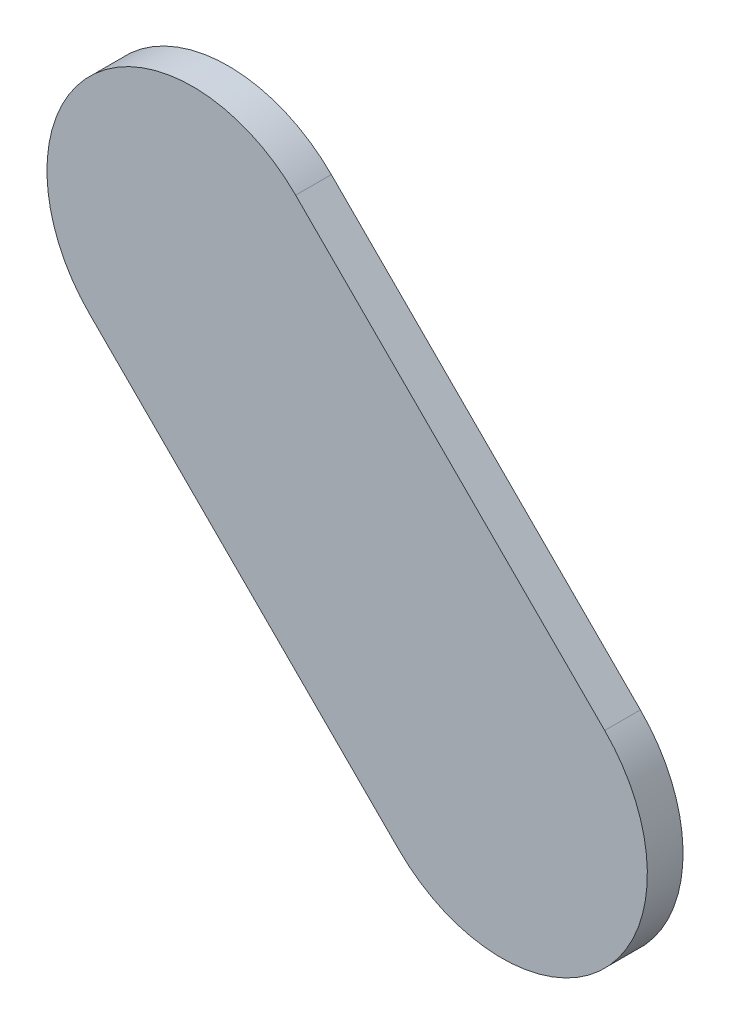
ISO-10303-21;
HEADER;
FILE_DESCRIPTION(('STEP AP214'),'2;1');
FILE_NAME('part.step','',(''),(''),'','','');
FILE_SCHEMA(('AUTOMOTIVE_DESIGN { 1 0 10303 214 1 1 1 1 }'));
ENDSEC;
DATA;
#1=APPLICATION_CONTEXT('core data for automotive mechanical design processes');
#2=APPLICATION_PROTOCOL_DEFINITION('international standard','automotive_design',2000,#1);
#3=PRODUCT_CONTEXT('',#1,'mechanical');
#4=PRODUCT('Part','Part','',(#3));
#5=PRODUCT_RELATED_PRODUCT_CATEGORY('part','',(#4));
#6=PRODUCT_DEFINITION_FORMATION('','',#4);
#7=PRODUCT_DEFINITION_CONTEXT('part definition',#1,'design');
#8=PRODUCT_DEFINITION('design','',#6,#7);
#9=PRODUCT_DEFINITION_SHAPE('','',#8);
#10=(LENGTH_UNIT() NAMED_UNIT(*) SI_UNIT(.MILLI.,.METRE.));
#11=(NAMED_UNIT(*) PLANE_ANGLE_UNIT() SI_UNIT($,.RADIAN.));
#12=(NAMED_UNIT(*) SI_UNIT($,.STERADIAN.) SOLID_ANGLE_UNIT());
#13=UNCERTAINTY_MEASURE_WITH_UNIT(LENGTH_MEASURE(1.E-05),#10,'distance_accuracy_value','');
#14=(GEOMETRIC_REPRESENTATION_CONTEXT(3) GLOBAL_UNCERTAINTY_ASSIGNED_CONTEXT((#13)) GLOBAL_UNIT_ASSIGNED_CONTEXT((#10,
#11,#12)) REPRESENTATION_CONTEXT('',''));
#15=CARTESIAN_POINT('',(0.,0.,0.));
#16=DIRECTION('',(0.,0.,1.));
#17=DIRECTION('',(1.,0.,0.));
#18=AXIS2_PLACEMENT_3D('',#15,#16,#17);
#19=CARTESIAN_POINT('',(3.725928999428,6.971484039131,0.79916));
#20=DIRECTION('',(0.,0.,1.));
#21=DIRECTION('',(1.,0.,0.));
#22=AXIS2_PLACEMENT_3D('',#19,#20,#21);
#23=PLANE('',#22);
#24=CARTESIAN_POINT('',(3.577543,7.119350434268,0.79916));
#25=DIRECTION('',(0.,0.,1.));
#26=DIRECTION('',(1.,0.,0.));
#27=AXIS2_PLACEMENT_3D('',#24,#25,#26);
#28=CIRCLE('',#27,0.140000472348);
#29=CARTESIAN_POINT('',(3.47854788883356,7.0203554441665,0.79916));
#30=VERTEX_POINT('',#29);
#31=CARTESIAN_POINT('',(3.67653836426737,7.21834563673356,0.79916));
#32=VERTEX_POINT('',#31);
#33=EDGE_CURVE('E20',#30,#32,#28,.F.);
#34=ORIENTED_EDGE('',*,*,#33,.F.);
#35=DIRECTION('',(-0.707107575236102,0.707105987136102,0.));
#36=VECTOR('',#35,1.);
#37=CARTESIAN_POINT('',(3.775533000001,6.723371000001,0.79916));
#38=LINE('',#37,#36);
#39=CARTESIAN_POINT('',(3.77553308090159,6.72337091910059,0.79916));
#40=VERTEX_POINT('',#39);
#41=EDGE_CURVE('E65',#30,#40,#38,.F.);
#42=ORIENTED_EDGE('',*,*,#41,.T.);
#43=CARTESIAN_POINT('',(3.874528,6.822365333,0.79916));
#44=DIRECTION('',(0.,0.,1.));
#45=DIRECTION('',(1.,0.,0.));
#46=AXIS2_PLACEMENT_3D('',#43,#44,#45);
#47=CIRCLE('',#46,0.140000072315);
#48=CARTESIAN_POINT('',(3.97352288933319,6.9213604446662,0.79916));
#49=VERTEX_POINT('',#48);
#50=EDGE_CURVE('E57',#49,#40,#47,.F.);
#51=ORIENTED_EDGE('',*,*,#50,.F.);
#52=DIRECTION('',(0.707105987136602,-0.707107575235602,0.));
#53=VECTOR('',#52,1.);
#54=CARTESIAN_POINT('',(3.676538334001,7.218345667,0.79916));
#55=LINE('',#54,#53);
#56=EDGE_CURVE('E64',#49,#32,#55,.F.);
#57=ORIENTED_EDGE('',*,*,#56,.T.);
#58=EDGE_LOOP('',(#34,#42,#51,#57));
#59=FACE_BOUND('',#58,.T.);
#60=ADVANCED_FACE('F17',(#59),#23,.T.);
#61=CARTESIAN_POINT('',(3.775533000001,6.723371000001,0.76487));
#62=DIRECTION('',(0.707105987136102,0.707107575236102,0.));
#63=DIRECTION('',(-0.707107575236102,0.707105987136102,0.));
#64=AXIS2_PLACEMENT_3D('',#61,#62,#63);
#65=PLANE('',#64);
#66=DIRECTION('',(0.,0.,1.));
#67=VECTOR('',#66,1.);
#68=CARTESIAN_POINT('',(3.47854800000002,7.02035533300002,0.76487));
#69=LINE('',#68,#67);
#70=CARTESIAN_POINT('',(3.47854788883345,7.02035544416632,0.76487));
#71=VERTEX_POINT('',#70);
#72=EDGE_CURVE('E68',#71,#30,#69,.T.);
#73=ORIENTED_EDGE('',*,*,#72,.F.);
#74=DIRECTION('',(-0.707107575236587,0.707105987135616,0.));
#75=VECTOR('',#74,1.);
#76=CARTESIAN_POINT('',(3.775533000001,6.723371000001,0.76487));
#77=LINE('',#76,#75);
#78=CARTESIAN_POINT('',(3.77553308090163,6.72337091910056,0.76487));
#79=VERTEX_POINT('',#78);
#80=EDGE_CURVE('E72',#79,#71,#77,.T.);
#81=ORIENTED_EDGE('',*,*,#80,.F.);
#82=DIRECTION('',(0.,0.,1.));
#83=VECTOR('',#82,1.);
#84=CARTESIAN_POINT('',(3.775533000001,6.723371000001,0.76487));
#85=LINE('',#84,#83);
#86=EDGE_CURVE('E60',#40,#79,#85,.F.);
#87=ORIENTED_EDGE('',*,*,#86,.F.);
#88=ORIENTED_EDGE('',*,*,#41,.F.);
#89=EDGE_LOOP('',(#73,#81,#87,#88));
#90=FACE_BOUND('',#89,.T.);
#91=ADVANCED_FACE('F70',(#90),#65,.F.);
#92=CARTESIAN_POINT('',(3.577543,7.119350434268,0.76487));
#93=DIRECTION('',(0.,0.,1.));
#94=DIRECTION('',(1.,0.,0.));
#95=AXIS2_PLACEMENT_3D('',#92,#93,#94);
#96=CYLINDRICAL_SURFACE('',#95,0.140000472348);
#97=DIRECTION('',(0.,0.,1.));
#98=VECTOR('',#97,1.);
#99=CARTESIAN_POINT('',(3.676538334001,7.218345667,0.76487));
#100=LINE('',#99,#98);
#101=CARTESIAN_POINT('',(3.67653836426735,7.21834563673358,0.76487));
#102=VERTEX_POINT('',#101);
#103=EDGE_CURVE('E77',#32,#102,#100,.F.);
#104=ORIENTED_EDGE('',*,*,#103,.T.);
#105=CARTESIAN_POINT('',(3.577542667,7.119350667,0.76487));
#106=DIRECTION('',(0.,0.,1.));
#107=DIRECTION('',(1.,0.,0.));
#108=AXIS2_PLACEMENT_3D('',#105,#106,#107);
#109=CIRCLE('',#108,0.140000072315);
#110=EDGE_CURVE('E26',#71,#102,#109,.F.);
#111=ORIENTED_EDGE('',*,*,#110,.F.);
#112=ORIENTED_EDGE('',*,*,#72,.T.);
#113=ORIENTED_EDGE('',*,*,#33,.T.);
#114=EDGE_LOOP('',(#104,#111,#112,#113));
#115=FACE_BOUND('',#114,.T.);
#116=ADVANCED_FACE('F88',(#115),#96,.T.);
#117=CARTESIAN_POINT('',(3.676538334001,7.218345667,0.76487));
#118=DIRECTION('',(-0.707107575235602,-0.707105987136602,0.));
#119=DIRECTION('',(0.707105987136602,-0.707107575235602,0.));
#120=AXIS2_PLACEMENT_3D('',#117,#118,#119);
#121=PLANE('',#120);
#122=DIRECTION('',(0.,0.,1.));
#123=VECTOR('',#122,1.);
#124=CARTESIAN_POINT('',(3.97352266699998,6.92136066699998,0.76487));
#125=LINE('',#124,#123);
#126=CARTESIAN_POINT('',(3.97352288933323,6.92136044466627,0.76487));
#127=VERTEX_POINT('',#126);
#128=EDGE_CURVE('E62',#127,#49,#125,.T.);
#129=ORIENTED_EDGE('',*,*,#128,.F.);
#130=DIRECTION('',(0.707105987136807,-0.707107575235397,0.));
#131=VECTOR('',#130,1.);
#132=CARTESIAN_POINT('',(3.676538334001,7.218345667,0.76487));
#133=LINE('',#132,#131);
#134=EDGE_CURVE('E11',#102,#127,#133,.T.);
#135=ORIENTED_EDGE('',*,*,#134,.F.);
#136=ORIENTED_EDGE('',*,*,#103,.F.);
#137=ORIENTED_EDGE('',*,*,#56,.F.);
#138=EDGE_LOOP('',(#129,#135,#136,#137));
#139=FACE_BOUND('',#138,.T.);
#140=ADVANCED_FACE('F96',(#139),#121,.F.);
#141=CARTESIAN_POINT('',(3.874528,6.822365333,0.76487));
#142=DIRECTION('',(0.,0.,1.));
#143=DIRECTION('',(1.,0.,0.));
#144=AXIS2_PLACEMENT_3D('',#141,#142,#143);
#145=CYLINDRICAL_SURFACE('',#144,0.140000072315);
#146=CARTESIAN_POINT('',(3.874528000001,6.822365898733,0.76487));
#147=DIRECTION('',(0.,0.,1.));
#148=DIRECTION('',(1.,0.,0.));
#149=AXIS2_PLACEMENT_3D('',#146,#147,#148);
#150=CIRCLE('',#149,0.14);
#151=EDGE_CURVE('E35',#127,#79,#150,.F.);
#152=ORIENTED_EDGE('',*,*,#151,.F.);
#153=ORIENTED_EDGE('',*,*,#128,.T.);
#154=ORIENTED_EDGE('',*,*,#50,.T.);
#155=ORIENTED_EDGE('',*,*,#86,.T.);
#156=EDGE_LOOP('',(#152,#153,#154,#155));
#157=FACE_BOUND('',#156,.T.);
#158=ADVANCED_FACE('F58',(#157),#145,.T.);
#159=CARTESIAN_POINT('',(3.725928999428,6.971484039131,0.76487));
#160=DIRECTION('',(0.,0.,-1.));
#161=DIRECTION('',(-1.,0.,0.));
#162=AXIS2_PLACEMENT_3D('',#159,#160,#161);
#163=PLANE('',#162);
#164=ORIENTED_EDGE('',*,*,#134,.T.);
#165=ORIENTED_EDGE('',*,*,#151,.T.);
#166=ORIENTED_EDGE('',*,*,#80,.T.);
#167=ORIENTED_EDGE('',*,*,#110,.T.);
#168=EDGE_LOOP('',(#164,#165,#166,#167));
#169=FACE_BOUND('',#168,.T.);
#170=ADVANCED_FACE('F89',(#169),#163,.T.);
#171=CLOSED_SHELL('',(#60,#91,#116,#140,#158,#170));
#172=MANIFOLD_SOLID_BREP('B1',#171);
#173=ADVANCED_BREP_SHAPE_REPRESENTATION('',(#18,#172),#14);
#174=SHAPE_DEFINITION_REPRESENTATION(#9,#173);
ENDSEC;
END-ISO-10303-21;
